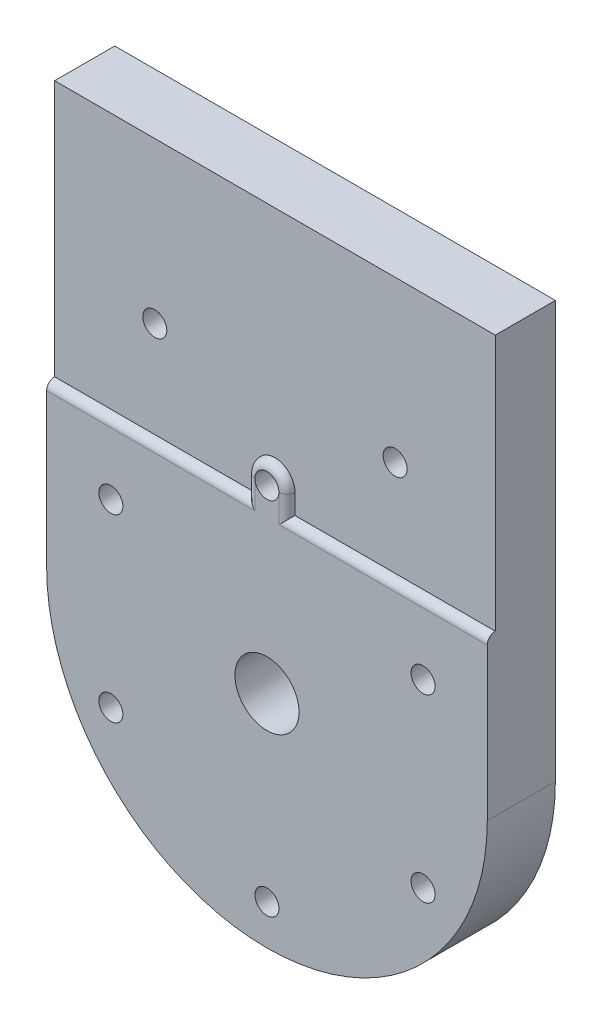
ISO-10303-21;
HEADER;
FILE_DESCRIPTION(('STEP AP214'),'2;1');
FILE_NAME('part.step','',(''),(''),'','','');
FILE_SCHEMA(('AUTOMOTIVE_DESIGN { 1 0 10303 214 1 1 1 1 }'));
ENDSEC;
DATA;
#1=APPLICATION_CONTEXT('core data for automotive mechanical design processes');
#2=APPLICATION_PROTOCOL_DEFINITION('international standard','automotive_design',2000,#1);
#3=PRODUCT_CONTEXT('',#1,'mechanical');
#4=PRODUCT('Part','Part','',(#3));
#5=PRODUCT_RELATED_PRODUCT_CATEGORY('part','',(#4));
#6=PRODUCT_DEFINITION_FORMATION('','',#4);
#7=PRODUCT_DEFINITION_CONTEXT('part definition',#1,'design');
#8=PRODUCT_DEFINITION('design','',#6,#7);
#9=PRODUCT_DEFINITION_SHAPE('','',#8);
#10=(LENGTH_UNIT() NAMED_UNIT(*) SI_UNIT(.MILLI.,.METRE.));
#11=(NAMED_UNIT(*) PLANE_ANGLE_UNIT() SI_UNIT($,.RADIAN.));
#12=(NAMED_UNIT(*) SI_UNIT($,.STERADIAN.) SOLID_ANGLE_UNIT());
#13=UNCERTAINTY_MEASURE_WITH_UNIT(LENGTH_MEASURE(1.E-05),#10,'distance_accuracy_value','');
#14=(GEOMETRIC_REPRESENTATION_CONTEXT(3) GLOBAL_UNCERTAINTY_ASSIGNED_CONTEXT((#13)) GLOBAL_UNIT_ASSIGNED_CONTEXT((#10,
#11,#12)) REPRESENTATION_CONTEXT('',''));
#15=CARTESIAN_POINT('',(0.,0.,0.));
#16=DIRECTION('',(0.,0.,1.));
#17=DIRECTION('',(1.,0.,0.));
#18=AXIS2_PLACEMENT_3D('',#15,#16,#17);
#19=CARTESIAN_POINT('',(19.4855715851503,11.2500000000007,0.));
#20=DIRECTION('',(0.,0.,1.));
#21=DIRECTION('',(1.,0.,0.));
#22=AXIS2_PLACEMENT_3D('',#19,#20,#21);
#23=CYLINDRICAL_SURFACE('',#22,1.50000000000181);
#24=CARTESIAN_POINT('',(19.4855715851503,11.2500000000007,8.5));
#25=DIRECTION('',(0.,0.,1.));
#26=DIRECTION('',(1.,0.,0.));
#27=AXIS2_PLACEMENT_3D('',#24,#25,#26);
#28=CIRCLE('',#27,1.50000000000181);
#29=CARTESIAN_POINT('',(20.9855715851521,11.2500000000007,8.5));
#30=VERTEX_POINT('',#29);
#31=EDGE_CURVE('E519',#30,#30,#28,.T.);
#32=ORIENTED_EDGE('',*,*,#31,.T.);
#33=EDGE_LOOP('',(#32));
#34=FACE_BOUND('',#33,.T.);
#35=CARTESIAN_POINT('',(19.4855715851503,11.2500000000007,4.));
#36=DIRECTION('',(0.,0.,-1.));
#37=DIRECTION('',(-1.,0.,0.));
#38=AXIS2_PLACEMENT_3D('',#35,#36,#37);
#39=CIRCLE('',#38,1.50000000000181);
#40=CARTESIAN_POINT('',(17.9855715851485,11.2500000000007,4.));
#41=VERTEX_POINT('',#40);
#42=EDGE_CURVE('E261',#41,#41,#39,.F.);
#43=ORIENTED_EDGE('',*,*,#42,.F.);
#44=EDGE_LOOP('',(#43));
#45=FACE_BOUND('',#44,.T.);
#46=ADVANCED_FACE('F257',(#34,#45),#23,.F.);
#47=CARTESIAN_POINT('',(0.,22.5,0.));
#48=DIRECTION('',(0.,0.,1.));
#49=DIRECTION('',(1.,0.,0.));
#50=AXIS2_PLACEMENT_3D('',#47,#48,#49);
#51=CYLINDRICAL_SURFACE('',#50,1.50000000000181);
#52=CARTESIAN_POINT('',(0.,22.5,8.5));
#53=DIRECTION('',(0.,0.,1.));
#54=DIRECTION('',(1.,0.,0.));
#55=AXIS2_PLACEMENT_3D('',#52,#53,#54);
#56=CIRCLE('',#55,1.50000000000181);
#57=CARTESIAN_POINT('',(1.50000000000001,22.5,8.5));
#58=VERTEX_POINT('',#57);
#59=CARTESIAN_POINT('',(-1.49999999999999,22.5,8.5));
#60=VERTEX_POINT('',#59);
#61=EDGE_CURVE('E362',#58,#60,#56,.T.);
#62=ORIENTED_EDGE('',*,*,#61,.T.);
#63=EDGE_CURVE('E518',#60,#58,#56,.T.);
#64=ORIENTED_EDGE('',*,*,#63,.T.);
#65=EDGE_LOOP('',(#62,#64));
#66=FACE_BOUND('',#65,.T.);
#67=CARTESIAN_POINT('',(0.,22.5,4.));
#68=DIRECTION('',(0.,0.,-1.));
#69=DIRECTION('',(-1.,0.,0.));
#70=AXIS2_PLACEMENT_3D('',#67,#68,#69);
#71=CIRCLE('',#70,1.50000000000181);
#72=CARTESIAN_POINT('',(-1.50000000000181,22.5,4.));
#73=VERTEX_POINT('',#72);
#74=EDGE_CURVE('E391',#73,#73,#71,.F.);
#75=ORIENTED_EDGE('',*,*,#74,.F.);
#76=EDGE_LOOP('',(#75));
#77=FACE_BOUND('',#76,.T.);
#78=ADVANCED_FACE('F403',(#66,#77),#51,.F.);
#79=CARTESIAN_POINT('',(1.70071014032744E-12,-22.5,0.));
#80=DIRECTION('',(0.,0.,1.));
#81=DIRECTION('',(1.,0.,0.));
#82=AXIS2_PLACEMENT_3D('',#79,#80,#81);
#83=CYLINDRICAL_SURFACE('',#82,1.50000000000181);
#84=CARTESIAN_POINT('',(1.70071014032744E-12,-22.5,8.5));
#85=DIRECTION('',(0.,0.,1.));
#86=DIRECTION('',(1.,0.,0.));
#87=AXIS2_PLACEMENT_3D('',#84,#85,#86);
#88=CIRCLE('',#87,1.50000000000181);
#89=CARTESIAN_POINT('',(1.50000000000351,-22.5,8.5));
#90=VERTEX_POINT('',#89);
#91=EDGE_CURVE('E537',#90,#90,#88,.T.);
#92=ORIENTED_EDGE('',*,*,#91,.T.);
#93=EDGE_LOOP('',(#92));
#94=FACE_BOUND('',#93,.T.);
#95=CARTESIAN_POINT('',(1.70071014032744E-12,-22.5,4.));
#96=DIRECTION('',(0.,0.,-1.));
#97=DIRECTION('',(-1.,0.,0.));
#98=AXIS2_PLACEMENT_3D('',#95,#96,#97);
#99=CIRCLE('',#98,1.50000000000181);
#100=CARTESIAN_POINT('',(-1.50000000000011,-22.5,4.));
#101=VERTEX_POINT('',#100);
#102=EDGE_CURVE('E388',#101,#101,#99,.F.);
#103=ORIENTED_EDGE('',*,*,#102,.F.);
#104=EDGE_LOOP('',(#103));
#105=FACE_BOUND('',#104,.T.);
#106=ADVANCED_FACE('F409',(#94,#105),#83,.F.);
#107=CARTESIAN_POINT('',(-19.4855715851486,-11.2500000000007,0.));
#108=DIRECTION('',(0.,0.,1.));
#109=DIRECTION('',(1.,0.,0.));
#110=AXIS2_PLACEMENT_3D('',#107,#108,#109);
#111=CYLINDRICAL_SURFACE('',#110,1.50000000000181);
#112=CARTESIAN_POINT('',(-19.4855715851486,-11.2500000000007,8.5));
#113=DIRECTION('',(0.,0.,1.));
#114=DIRECTION('',(1.,0.,0.));
#115=AXIS2_PLACEMENT_3D('',#112,#113,#114);
#116=CIRCLE('',#115,1.50000000000181);
#117=CARTESIAN_POINT('',(-17.9855715851468,-11.2500000000007,8.5));
#118=VERTEX_POINT('',#117);
#119=EDGE_CURVE('E533',#118,#118,#116,.T.);
#120=ORIENTED_EDGE('',*,*,#119,.T.);
#121=EDGE_LOOP('',(#120));
#122=FACE_BOUND('',#121,.T.);
#123=CARTESIAN_POINT('',(-19.4855715851486,-11.2500000000007,4.));
#124=DIRECTION('',(0.,0.,-1.));
#125=DIRECTION('',(-1.,0.,0.));
#126=AXIS2_PLACEMENT_3D('',#123,#124,#125);
#127=CIRCLE('',#126,1.50000000000181);
#128=CARTESIAN_POINT('',(-20.9855715851504,-11.2500000000007,4.));
#129=VERTEX_POINT('',#128);
#130=EDGE_CURVE('E384',#129,#129,#127,.F.);
#131=ORIENTED_EDGE('',*,*,#130,.F.);
#132=EDGE_LOOP('',(#131));
#133=FACE_BOUND('',#132,.T.);
#134=ADVANCED_FACE('F429',(#122,#133),#111,.F.);
#135=CARTESIAN_POINT('',(-19.4855715851495,11.2499999999992,0.));
#136=DIRECTION('',(0.,0.,1.));
#137=DIRECTION('',(1.,0.,0.));
#138=AXIS2_PLACEMENT_3D('',#135,#136,#137);
#139=CYLINDRICAL_SURFACE('',#138,1.50000000000181);
#140=CARTESIAN_POINT('',(-19.4855715851495,11.2499999999992,8.5));
#141=DIRECTION('',(0.,0.,1.));
#142=DIRECTION('',(1.,0.,0.));
#143=AXIS2_PLACEMENT_3D('',#140,#141,#142);
#144=CIRCLE('',#143,1.50000000000181);
#145=CARTESIAN_POINT('',(-17.9855715851476,11.2499999999992,8.5));
#146=VERTEX_POINT('',#145);
#147=EDGE_CURVE('E529',#146,#146,#144,.T.);
#148=ORIENTED_EDGE('',*,*,#147,.T.);
#149=EDGE_LOOP('',(#148));
#150=FACE_BOUND('',#149,.T.);
#151=CARTESIAN_POINT('',(-19.4855715851495,11.2499999999992,4.));
#152=DIRECTION('',(0.,0.,-1.));
#153=DIRECTION('',(-1.,0.,0.));
#154=AXIS2_PLACEMENT_3D('',#151,#152,#153);
#155=CIRCLE('',#154,1.50000000000181);
#156=CARTESIAN_POINT('',(-20.9855715851513,11.2499999999992,4.));
#157=VERTEX_POINT('',#156);
#158=EDGE_CURVE('E379',#157,#157,#155,.F.);
#159=ORIENTED_EDGE('',*,*,#158,.F.);
#160=EDGE_LOOP('',(#159));
#161=FACE_BOUND('',#160,.T.);
#162=ADVANCED_FACE('F425',(#150,#161),#139,.F.);
#163=CARTESIAN_POINT('',(19.4855715851511,-11.2499999999993,0.));
#164=DIRECTION('',(0.,0.,1.));
#165=DIRECTION('',(1.,0.,0.));
#166=AXIS2_PLACEMENT_3D('',#163,#164,#165);
#167=CYLINDRICAL_SURFACE('',#166,1.50000000000181);
#168=CARTESIAN_POINT('',(19.4855715851511,-11.2499999999993,8.5));
#169=DIRECTION('',(0.,0.,1.));
#170=DIRECTION('',(1.,0.,0.));
#171=AXIS2_PLACEMENT_3D('',#168,#169,#170);
#172=CIRCLE('',#171,1.50000000000181);
#173=CARTESIAN_POINT('',(20.985571585153,-11.2499999999993,8.5));
#174=VERTEX_POINT('',#173);
#175=EDGE_CURVE('E517',#174,#174,#172,.T.);
#176=ORIENTED_EDGE('',*,*,#175,.T.);
#177=EDGE_LOOP('',(#176));
#178=FACE_BOUND('',#177,.T.);
#179=CARTESIAN_POINT('',(19.4855715851511,-11.2499999999993,4.));
#180=DIRECTION('',(0.,0.,-1.));
#181=DIRECTION('',(-1.,0.,0.));
#182=AXIS2_PLACEMENT_3D('',#179,#180,#181);
#183=CIRCLE('',#182,1.50000000000181);
#184=CARTESIAN_POINT('',(17.9855715851493,-11.2499999999993,4.));
#185=VERTEX_POINT('',#184);
#186=EDGE_CURVE('E375',#185,#185,#183,.F.);
#187=ORIENTED_EDGE('',*,*,#186,.F.);
#188=EDGE_LOOP('',(#187));
#189=FACE_BOUND('',#188,.T.);
#190=ADVANCED_FACE('F428',(#178,#189),#167,.F.);
#191=CARTESIAN_POINT('',(0.,52.,8.5));
#192=DIRECTION('',(0.,1.,0.));
#193=DIRECTION('',(0.,0.,1.));
#194=AXIS2_PLACEMENT_3D('',#191,#192,#193);
#195=PLANE('',#194);
#196=DIRECTION('',(0.,0.,1.));
#197=VECTOR('',#196,1.);
#198=CARTESIAN_POINT('',(-27.5,52.,0.));
#199=LINE('',#198,#197);
#200=CARTESIAN_POINT('',(-27.5,52.,0.));
#201=VERTEX_POINT('',#200);
#202=CARTESIAN_POINT('',(-27.5,52.,7.5));
#203=VERTEX_POINT('',#202);
#204=EDGE_CURVE('E573',#201,#203,#199,.T.);
#205=ORIENTED_EDGE('',*,*,#204,.T.);
#206=DIRECTION('',(-1.,0.,0.));
#207=VECTOR('',#206,1.);
#208=CARTESIAN_POINT('',(0.,52.,7.5));
#209=LINE('',#208,#207);
#210=CARTESIAN_POINT('',(27.5,52.,7.5));
#211=VERTEX_POINT('',#210);
#212=EDGE_CURVE('E494',#211,#203,#209,.T.);
#213=ORIENTED_EDGE('',*,*,#212,.F.);
#214=DIRECTION('',(0.,0.,1.));
#215=VECTOR('',#214,1.);
#216=CARTESIAN_POINT('',(27.5,52.,0.));
#217=LINE('',#216,#215);
#218=CARTESIAN_POINT('',(27.5,52.,0.));
#219=VERTEX_POINT('',#218);
#220=EDGE_CURVE('E569',#219,#211,#217,.T.);
#221=ORIENTED_EDGE('',*,*,#220,.F.);
#222=DIRECTION('',(1.,0.,0.));
#223=VECTOR('',#222,1.);
#224=CARTESIAN_POINT('',(0.,52.,0.));
#225=LINE('',#224,#223);
#226=EDGE_CURVE('E582',#201,#219,#225,.T.);
#227=ORIENTED_EDGE('',*,*,#226,.F.);
#228=EDGE_LOOP('',(#205,#213,#221,#227));
#229=FACE_BOUND('',#228,.T.);
#230=ADVANCED_FACE('F423',(#229),#195,.T.);
#231=CARTESIAN_POINT('',(15.,32.,0.));
#232=DIRECTION('',(0.,0.,1.));
#233=DIRECTION('',(1.,0.,0.));
#234=AXIS2_PLACEMENT_3D('',#231,#232,#233);
#235=CYLINDRICAL_SURFACE('',#234,1.5);
#236=CARTESIAN_POINT('',(15.,32.,0.));
#237=DIRECTION('',(0.,0.,1.));
#238=DIRECTION('',(1.,0.,0.));
#239=AXIS2_PLACEMENT_3D('',#236,#237,#238);
#240=CIRCLE('',#239,1.5);
#241=CARTESIAN_POINT('',(16.5,32.,0.));
#242=VERTEX_POINT('',#241);
#243=EDGE_CURVE('E514',#242,#242,#240,.T.);
#244=ORIENTED_EDGE('',*,*,#243,.F.);
#245=EDGE_LOOP('',(#244));
#246=FACE_BOUND('',#245,.T.);
#247=CARTESIAN_POINT('',(15.,32.,7.5));
#248=DIRECTION('',(0.,0.,1.));
#249=DIRECTION('',(1.,0.,0.));
#250=AXIS2_PLACEMENT_3D('',#247,#248,#249);
#251=CIRCLE('',#250,1.5);
#252=CARTESIAN_POINT('',(16.5,32.,7.5));
#253=VERTEX_POINT('',#252);
#254=EDGE_CURVE('E510',#253,#253,#251,.F.);
#255=ORIENTED_EDGE('',*,*,#254,.F.);
#256=EDGE_LOOP('',(#255));
#257=FACE_BOUND('',#256,.T.);
#258=ADVANCED_FACE('F419',(#246,#257),#235,.F.);
#259=CARTESIAN_POINT('',(-15.,32.,0.));
#260=DIRECTION('',(0.,0.,1.));
#261=DIRECTION('',(1.,0.,0.));
#262=AXIS2_PLACEMENT_3D('',#259,#260,#261);
#263=CYLINDRICAL_SURFACE('',#262,1.5);
#264=CARTESIAN_POINT('',(-15.,32.,0.));
#265=DIRECTION('',(0.,0.,1.));
#266=DIRECTION('',(1.,0.,0.));
#267=AXIS2_PLACEMENT_3D('',#264,#265,#266);
#268=CIRCLE('',#267,1.5);
#269=CARTESIAN_POINT('',(-13.5,32.,0.));
#270=VERTEX_POINT('',#269);
#271=EDGE_CURVE('E522',#270,#270,#268,.T.);
#272=ORIENTED_EDGE('',*,*,#271,.F.);
#273=EDGE_LOOP('',(#272));
#274=FACE_BOUND('',#273,.T.);
#275=CARTESIAN_POINT('',(-15.,32.,7.5));
#276=DIRECTION('',(0.,0.,1.));
#277=DIRECTION('',(1.,0.,0.));
#278=AXIS2_PLACEMENT_3D('',#275,#276,#277);
#279=CIRCLE('',#278,1.5);
#280=CARTESIAN_POINT('',(-13.5,32.,7.5));
#281=VERTEX_POINT('',#280);
#282=EDGE_CURVE('E506',#281,#281,#279,.F.);
#283=ORIENTED_EDGE('',*,*,#282,.F.);
#284=EDGE_LOOP('',(#283));
#285=FACE_BOUND('',#284,.T.);
#286=ADVANCED_FACE('F415',(#274,#285),#263,.F.);
#287=CARTESIAN_POINT('',(0.,0.,8.5));
#288=DIRECTION('',(0.,0.,1.));
#289=DIRECTION('',(1.,0.,0.));
#290=AXIS2_PLACEMENT_3D('',#287,#288,#289);
#291=PLANE('',#290);
#292=ORIENTED_EDGE('',*,*,#175,.F.);
#293=EDGE_LOOP('',(#292));
#294=FACE_BOUND('',#293,.T.);
#295=ORIENTED_EDGE('',*,*,#147,.F.);
#296=EDGE_LOOP('',(#295));
#297=FACE_BOUND('',#296,.T.);
#298=ORIENTED_EDGE('',*,*,#119,.F.);
#299=EDGE_LOOP('',(#298));
#300=FACE_BOUND('',#299,.T.);
#301=ORIENTED_EDGE('',*,*,#91,.F.);
#302=EDGE_LOOP('',(#301));
#303=FACE_BOUND('',#302,.T.);
#304=DIRECTION('',(1.,0.,0.));
#305=VECTOR('',#304,1.);
#306=CARTESIAN_POINT('',(2.50000000000001,19.,8.5));
#307=LINE('',#306,#305);
#308=CARTESIAN_POINT('',(27.5,19.,8.5));
#309=VERTEX_POINT('',#308);
#310=CARTESIAN_POINT('',(1.50000000000001,19.,8.5));
#311=VERTEX_POINT('',#310);
#312=EDGE_CURVE('E275',#309,#311,#307,.F.);
#313=ORIENTED_EDGE('',*,*,#312,.T.);
#314=DIRECTION('',(0.,1.,0.));
#315=VECTOR('',#314,1.);
#316=CARTESIAN_POINT('',(1.50000000000002,0.,8.5));
#317=LINE('',#316,#315);
#318=EDGE_CURVE('E595',#311,#58,#317,.T.);
#319=ORIENTED_EDGE('',*,*,#318,.T.);
#320=ORIENTED_EDGE('',*,*,#63,.F.);
#321=DIRECTION('',(0.,1.,0.));
#322=VECTOR('',#321,1.);
#323=CARTESIAN_POINT('',(-1.49999999999999,20.,8.5));
#324=LINE('',#323,#322);
#325=CARTESIAN_POINT('',(-1.49999999999999,19.,8.5));
#326=VERTEX_POINT('',#325);
#327=EDGE_CURVE('E282',#60,#326,#324,.F.);
#328=ORIENTED_EDGE('',*,*,#327,.T.);
#329=DIRECTION('',(1.,0.,0.));
#330=VECTOR('',#329,1.);
#331=CARTESIAN_POINT('',(-27.5,19.,8.5));
#332=LINE('',#331,#330);
#333=CARTESIAN_POINT('',(-27.5,19.,8.5));
#334=VERTEX_POINT('',#333);
#335=EDGE_CURVE('E484',#326,#334,#332,.F.);
#336=ORIENTED_EDGE('',*,*,#335,.T.);
#337=DIRECTION('',(0.,1.,0.));
#338=VECTOR('',#337,1.);
#339=CARTESIAN_POINT('',(-27.5,0.,8.5));
#340=LINE('',#339,#338);
#341=CARTESIAN_POINT('',(-27.5,0.,8.5));
#342=VERTEX_POINT('',#341);
#343=EDGE_CURVE('E492',#342,#334,#340,.T.);
#344=ORIENTED_EDGE('',*,*,#343,.F.);
#345=CARTESIAN_POINT('',(0.,0.,8.5));
#346=DIRECTION('',(0.,0.,1.));
#347=DIRECTION('',(1.,0.,0.));
#348=AXIS2_PLACEMENT_3D('',#345,#346,#347);
#349=CIRCLE('',#348,27.5);
#350=CARTESIAN_POINT('',(27.5,0.,8.5));
#351=VERTEX_POINT('',#350);
#352=EDGE_CURVE('E541',#342,#351,#349,.T.);
#353=ORIENTED_EDGE('',*,*,#352,.T.);
#354=DIRECTION('',(0.,1.,0.));
#355=VECTOR('',#354,1.);
#356=CARTESIAN_POINT('',(27.5,0.,8.5));
#357=LINE('',#356,#355);
#358=EDGE_CURVE('E549',#351,#309,#357,.T.);
#359=ORIENTED_EDGE('',*,*,#358,.T.);
#360=EDGE_LOOP('',(#313,#319,#320,#328,#336,#344,#353,#359));
#361=FACE_BOUND('',#360,.T.);
#362=ORIENTED_EDGE('',*,*,#31,.F.);
#363=EDGE_LOOP('',(#362));
#364=FACE_BOUND('',#363,.T.);
#365=CARTESIAN_POINT('',(0.,0.,8.5));
#366=DIRECTION('',(0.,0.,1.));
#367=DIRECTION('',(1.,0.,0.));
#368=AXIS2_PLACEMENT_3D('',#365,#366,#367);
#369=CIRCLE('',#368,4.);
#370=CARTESIAN_POINT('',(4.,0.,8.5));
#371=VERTEX_POINT('',#370);
#372=EDGE_CURVE('E578',#371,#371,#369,.T.);
#373=ORIENTED_EDGE('',*,*,#372,.F.);
#374=EDGE_LOOP('',(#373));
#375=FACE_BOUND('',#374,.T.);
#376=ADVANCED_FACE('F418',(#294,#297,#300,#303,#361,#364,#375),#291,.T.);
#377=CARTESIAN_POINT('',(0.,0.,0.));
#378=DIRECTION('',(0.,0.,1.));
#379=DIRECTION('',(1.,0.,0.));
#380=AXIS2_PLACEMENT_3D('',#377,#378,#379);
#381=PLANE('',#380);
#382=CARTESIAN_POINT('',(0.,22.5,0.));
#383=DIRECTION('',(0.,0.,-1.));
#384=DIRECTION('',(-1.,0.,0.));
#385=AXIS2_PLACEMENT_3D('',#382,#383,#384);
#386=CIRCLE('',#385,3.);
#387=CARTESIAN_POINT('',(-3.,22.5,0.));
#388=VERTEX_POINT('',#387);
#389=EDGE_CURVE('E643',#388,#388,#386,.T.);
#390=ORIENTED_EDGE('',*,*,#389,.F.);
#391=EDGE_LOOP('',(#390));
#392=FACE_BOUND('',#391,.T.);
#393=CARTESIAN_POINT('',(19.4855715851492,11.2499999999989,0.));
#394=DIRECTION('',(0.,0.,-1.));
#395=DIRECTION('',(-1.,0.,0.));
#396=AXIS2_PLACEMENT_3D('',#393,#394,#395);
#397=CIRCLE('',#396,3.0000000000012);
#398=CARTESIAN_POINT('',(16.485571585148,11.2499999999989,0.));
#399=VERTEX_POINT('',#398);
#400=EDGE_CURVE('E644',#399,#399,#397,.T.);
#401=ORIENTED_EDGE('',*,*,#400,.F.);
#402=EDGE_LOOP('',(#401));
#403=FACE_BOUND('',#402,.T.);
#404=CARTESIAN_POINT('',(19.485571585148,-11.2500000000011,0.));
#405=DIRECTION('',(0.,0.,-1.));
#406=DIRECTION('',(-1.,0.,0.));
#407=AXIS2_PLACEMENT_3D('',#404,#405,#406);
#408=CIRCLE('',#407,3.00000000000236);
#409=CARTESIAN_POINT('',(16.4855715851456,-11.2500000000011,0.));
#410=VERTEX_POINT('',#409);
#411=EDGE_CURVE('E610',#410,#410,#408,.T.);
#412=ORIENTED_EDGE('',*,*,#411,.F.);
#413=EDGE_LOOP('',(#412));
#414=FACE_BOUND('',#413,.T.);
#415=CARTESIAN_POINT('',(-2.54968748284212E-12,-22.5,0.));
#416=DIRECTION('',(0.,0.,-1.));
#417=DIRECTION('',(-1.,0.,0.));
#418=AXIS2_PLACEMENT_3D('',#415,#416,#417);
#419=CIRCLE('',#418,3.00000000000259);
#420=CARTESIAN_POINT('',(-3.00000000000514,-22.5,0.));
#421=VERTEX_POINT('',#420);
#422=EDGE_CURVE('E619',#421,#421,#419,.T.);
#423=ORIENTED_EDGE('',*,*,#422,.F.);
#424=EDGE_LOOP('',(#423));
#425=FACE_BOUND('',#424,.T.);
#426=CARTESIAN_POINT('',(-19.4855715851518,-11.2499999999989,0.));
#427=DIRECTION('',(0.,0.,-1.));
#428=DIRECTION('',(-1.,0.,0.));
#429=AXIS2_PLACEMENT_3D('',#426,#427,#428);
#430=CIRCLE('',#429,3.00000000000161);
#431=CARTESIAN_POINT('',(-22.4855715851534,-11.2499999999989,0.));
#432=VERTEX_POINT('',#431);
#433=EDGE_CURVE('E627',#432,#432,#430,.T.);
#434=ORIENTED_EDGE('',*,*,#433,.F.);
#435=EDGE_LOOP('',(#434));
#436=FACE_BOUND('',#435,.T.);
#437=CARTESIAN_POINT('',(-19.4855715851505,11.2500000000011,0.));
#438=DIRECTION('',(0.,0.,-1.));
#439=DIRECTION('',(-1.,0.,0.));
#440=AXIS2_PLACEMENT_3D('',#437,#438,#439);
#441=CIRCLE('',#440,3.00000000000034);
#442=CARTESIAN_POINT('',(-22.4855715851508,11.2500000000011,0.));
#443=VERTEX_POINT('',#442);
#444=EDGE_CURVE('E635',#443,#443,#441,.T.);
#445=ORIENTED_EDGE('',*,*,#444,.F.);
#446=EDGE_LOOP('',(#445));
#447=FACE_BOUND('',#446,.T.);
#448=ORIENTED_EDGE('',*,*,#271,.T.);
#449=EDGE_LOOP('',(#448));
#450=FACE_BOUND('',#449,.T.);
#451=ORIENTED_EDGE('',*,*,#243,.T.);
#452=EDGE_LOOP('',(#451));
#453=FACE_BOUND('',#452,.T.);
#454=CARTESIAN_POINT('',(0.,0.,0.));
#455=DIRECTION('',(0.,0.,1.));
#456=DIRECTION('',(1.,0.,0.));
#457=AXIS2_PLACEMENT_3D('',#454,#455,#456);
#458=CIRCLE('',#457,4.);
#459=CARTESIAN_POINT('',(4.,0.,0.));
#460=VERTEX_POINT('',#459);
#461=EDGE_CURVE('E568',#460,#460,#458,.T.);
#462=ORIENTED_EDGE('',*,*,#461,.T.);
#463=EDGE_LOOP('',(#462));
#464=FACE_BOUND('',#463,.T.);
#465=DIRECTION('',(0.,1.,0.));
#466=VECTOR('',#465,1.);
#467=CARTESIAN_POINT('',(27.5,0.,0.));
#468=LINE('',#467,#466);
#469=CARTESIAN_POINT('',(27.5,0.,0.));
#470=VERTEX_POINT('',#469);
#471=EDGE_CURVE('E553',#470,#219,#468,.T.);
#472=ORIENTED_EDGE('',*,*,#471,.F.);
#473=CARTESIAN_POINT('',(0.,0.,0.));
#474=DIRECTION('',(0.,0.,1.));
#475=DIRECTION('',(1.,0.,0.));
#476=AXIS2_PLACEMENT_3D('',#473,#474,#475);
#477=CIRCLE('',#476,27.5);
#478=CARTESIAN_POINT('',(-27.5,0.,0.));
#479=VERTEX_POINT('',#478);
#480=EDGE_CURVE('E545',#479,#470,#477,.T.);
#481=ORIENTED_EDGE('',*,*,#480,.F.);
#482=DIRECTION('',(0.,1.,0.));
#483=VECTOR('',#482,1.);
#484=CARTESIAN_POINT('',(-27.5,0.,0.));
#485=LINE('',#484,#483);
#486=EDGE_CURVE('E548',#479,#201,#485,.T.);
#487=ORIENTED_EDGE('',*,*,#486,.T.);
#488=ORIENTED_EDGE('',*,*,#226,.T.);
#489=EDGE_LOOP('',(#472,#481,#487,#488));
#490=FACE_BOUND('',#489,.T.);
#491=ADVANCED_FACE('F455',(#392,#403,#414,#425,#436,#447,#450,#453,#464,#490),#381,.F.);
#492=CARTESIAN_POINT('',(0.,0.,8.5));
#493=DIRECTION('',(0.,0.,-1.));
#494=DIRECTION('',(-1.,0.,0.));
#495=AXIS2_PLACEMENT_3D('',#492,#493,#494);
#496=CYLINDRICAL_SURFACE('',#495,4.);
#497=ORIENTED_EDGE('',*,*,#372,.T.);
#498=EDGE_LOOP('',(#497));
#499=FACE_BOUND('',#498,.T.);
#500=ORIENTED_EDGE('',*,*,#461,.F.);
#501=EDGE_LOOP('',(#500));
#502=FACE_BOUND('',#501,.T.);
#503=ADVANCED_FACE('F451',(#499,#502),#496,.F.);
#504=CARTESIAN_POINT('',(0.,0.,0.));
#505=DIRECTION('',(0.,0.,1.));
#506=DIRECTION('',(1.,0.,0.));
#507=AXIS2_PLACEMENT_3D('',#504,#505,#506);
#508=CYLINDRICAL_SURFACE('',#507,27.5);
#509=ORIENTED_EDGE('',*,*,#352,.F.);
#510=DIRECTION('',(0.,0.,1.));
#511=VECTOR('',#510,1.);
#512=CARTESIAN_POINT('',(-27.5,0.,0.));
#513=LINE('',#512,#511);
#514=EDGE_CURVE('E556',#479,#342,#513,.T.);
#515=ORIENTED_EDGE('',*,*,#514,.F.);
#516=ORIENTED_EDGE('',*,*,#480,.T.);
#517=DIRECTION('',(0.,0.,1.));
#518=VECTOR('',#517,1.);
#519=CARTESIAN_POINT('',(27.5,0.,0.));
#520=LINE('',#519,#518);
#521=EDGE_CURVE('E564',#470,#351,#520,.T.);
#522=ORIENTED_EDGE('',*,*,#521,.T.);
#523=EDGE_LOOP('',(#509,#515,#516,#522));
#524=FACE_BOUND('',#523,.T.);
#525=ADVANCED_FACE('F444',(#524),#508,.T.);
#526=CARTESIAN_POINT('',(27.5,0.,0.));
#527=DIRECTION('',(1.,0.,0.));
#528=DIRECTION('',(0.,1.,0.));
#529=AXIS2_PLACEMENT_3D('',#526,#527,#528);
#530=PLANE('',#529);
#531=DIRECTION('',(0.,1.,0.));
#532=VECTOR('',#531,1.);
#533=CARTESIAN_POINT('',(27.5,0.,7.5));
#534=LINE('',#533,#532);
#535=CARTESIAN_POINT('',(27.5,20.,7.5));
#536=VERTEX_POINT('',#535);
#537=EDGE_CURVE('E500',#536,#211,#534,.T.);
#538=ORIENTED_EDGE('',*,*,#537,.F.);
#539=CARTESIAN_POINT('',(27.5,19.,7.5));
#540=DIRECTION('',(1.,0.,0.));
#541=DIRECTION('',(0.,1.,0.));
#542=AXIS2_PLACEMENT_3D('',#539,#540,#541);
#543=CIRCLE('',#542,1.);
#544=EDGE_CURVE('E267',#536,#309,#543,.T.);
#545=ORIENTED_EDGE('',*,*,#544,.T.);
#546=ORIENTED_EDGE('',*,*,#358,.F.);
#547=ORIENTED_EDGE('',*,*,#521,.F.);
#548=ORIENTED_EDGE('',*,*,#471,.T.);
#549=ORIENTED_EDGE('',*,*,#220,.T.);
#550=EDGE_LOOP('',(#538,#545,#546,#547,#548,#549));
#551=FACE_BOUND('',#550,.T.);
#552=ADVANCED_FACE('F440',(#551),#530,.T.);
#553=CARTESIAN_POINT('',(-27.5,0.,0.));
#554=DIRECTION('',(1.,0.,0.));
#555=DIRECTION('',(0.,1.,0.));
#556=AXIS2_PLACEMENT_3D('',#553,#554,#555);
#557=PLANE('',#556);
#558=ORIENTED_EDGE('',*,*,#343,.T.);
#559=CARTESIAN_POINT('',(-27.5,19.,7.5));
#560=DIRECTION('',(1.,0.,0.));
#561=DIRECTION('',(0.,1.,0.));
#562=AXIS2_PLACEMENT_3D('',#559,#560,#561);
#563=CIRCLE('',#562,1.);
#564=CARTESIAN_POINT('',(-27.5,20.,7.5));
#565=VERTEX_POINT('',#564);
#566=EDGE_CURVE('E12',#334,#565,#563,.F.);
#567=ORIENTED_EDGE('',*,*,#566,.T.);
#568=DIRECTION('',(0.,-1.,0.));
#569=VECTOR('',#568,1.);
#570=CARTESIAN_POINT('',(-27.5,0.,7.5));
#571=LINE('',#570,#569);
#572=EDGE_CURVE('E489',#203,#565,#571,.T.);
#573=ORIENTED_EDGE('',*,*,#572,.F.);
#574=ORIENTED_EDGE('',*,*,#204,.F.);
#575=ORIENTED_EDGE('',*,*,#486,.F.);
#576=ORIENTED_EDGE('',*,*,#514,.T.);
#577=EDGE_LOOP('',(#558,#567,#573,#574,#575,#576));
#578=FACE_BOUND('',#577,.T.);
#579=ADVANCED_FACE('F443',(#578),#557,.F.);
#580=CARTESIAN_POINT('',(0.,0.,7.5));
#581=DIRECTION('',(0.,0.,1.));
#582=DIRECTION('',(1.,0.,0.));
#583=AXIS2_PLACEMENT_3D('',#580,#581,#582);
#584=PLANE('',#583);
#585=CARTESIAN_POINT('',(0.,22.5,7.5));
#586=DIRECTION('',(0.,0.,1.));
#587=DIRECTION('',(1.,0.,0.));
#588=AXIS2_PLACEMENT_3D('',#585,#586,#587);
#589=CIRCLE('',#588,2.5);
#590=CARTESIAN_POINT('',(2.50000000000001,22.5,7.5));
#591=VERTEX_POINT('',#590);
#592=CARTESIAN_POINT('',(-2.49999999999999,22.5,7.5));
#593=VERTEX_POINT('',#592);
#594=EDGE_CURVE('E336',#591,#593,#589,.T.);
#595=ORIENTED_EDGE('',*,*,#594,.F.);
#596=DIRECTION('',(0.,1.,0.));
#597=VECTOR('',#596,1.);
#598=CARTESIAN_POINT('',(2.50000000000002,0.,7.5));
#599=LINE('',#598,#597);
#600=CARTESIAN_POINT('',(2.50000000000001,20.,7.5));
#601=VERTEX_POINT('',#600);
#602=EDGE_CURVE('E340',#601,#591,#599,.T.);
#603=ORIENTED_EDGE('',*,*,#602,.F.);
#604=DIRECTION('',(1.,0.,0.));
#605=VECTOR('',#604,1.);
#606=CARTESIAN_POINT('',(0.,20.,7.5));
#607=LINE('',#606,#605);
#608=EDGE_CURVE('E358',#601,#536,#607,.T.);
#609=ORIENTED_EDGE('',*,*,#608,.T.);
#610=ORIENTED_EDGE('',*,*,#537,.T.);
#611=ORIENTED_EDGE('',*,*,#212,.T.);
#612=ORIENTED_EDGE('',*,*,#572,.T.);
#613=CARTESIAN_POINT('',(-2.49999999999999,20.,7.5));
#614=VERTEX_POINT('',#613);
#615=EDGE_CURVE('E485',#565,#614,#607,.T.);
#616=ORIENTED_EDGE('',*,*,#615,.T.);
#617=DIRECTION('',(0.,1.,0.));
#618=VECTOR('',#617,1.);
#619=CARTESIAN_POINT('',(-2.49999999999998,0.,7.5));
#620=LINE('',#619,#618);
#621=EDGE_CURVE('E343',#614,#593,#620,.T.);
#622=ORIENTED_EDGE('',*,*,#621,.T.);
#623=EDGE_LOOP('',(#595,#603,#609,#610,#611,#612,#616,#622));
#624=FACE_BOUND('',#623,.T.);
#625=ORIENTED_EDGE('',*,*,#282,.T.);
#626=EDGE_LOOP('',(#625));
#627=FACE_BOUND('',#626,.T.);
#628=ORIENTED_EDGE('',*,*,#254,.T.);
#629=EDGE_LOOP('',(#628));
#630=FACE_BOUND('',#629,.T.);
#631=ADVANCED_FACE('F338',(#624,#627,#630),#584,.T.);
#632=CARTESIAN_POINT('',(0.,19.,7.5));
#633=DIRECTION('',(-1.,0.,0.));
#634=DIRECTION('',(0.,0.,1.));
#635=AXIS2_PLACEMENT_3D('',#632,#633,#634);
#636=CYLINDRICAL_SURFACE('',#635,1.);
#637=ORIENTED_EDGE('',*,*,#544,.F.);
#638=ORIENTED_EDGE('',*,*,#608,.F.);
#639=CARTESIAN_POINT('',(1.50000000000001,19.,7.5));
#640=DIRECTION('',(-0.707106781186548,0.707106781186547,0.));
#641=DIRECTION('',(0.707106781186547,0.707106781186548,0.));
#642=AXIS2_PLACEMENT_3D('',#639,#640,#641);
#643=ELLIPSE('',#642,1.41421356237309,1.);
#644=EDGE_CURVE('E348',#311,#601,#643,.T.);
#645=ORIENTED_EDGE('',*,*,#644,.F.);
#646=ORIENTED_EDGE('',*,*,#312,.F.);
#647=EDGE_LOOP('',(#637,#638,#645,#646));
#648=FACE_BOUND('',#647,.T.);
#649=ADVANCED_FACE('F259',(#648),#636,.T.);
#650=CARTESIAN_POINT('',(0.,19.,7.5));
#651=DIRECTION('',(-1.,0.,0.));
#652=DIRECTION('',(0.,0.,1.));
#653=AXIS2_PLACEMENT_3D('',#650,#651,#652);
#654=CYLINDRICAL_SURFACE('',#653,1.);
#655=ORIENTED_EDGE('',*,*,#566,.F.);
#656=ORIENTED_EDGE('',*,*,#335,.F.);
#657=CARTESIAN_POINT('',(-1.49999999999999,19.,7.5));
#658=DIRECTION('',(-0.707106781186547,-0.707106781186548,0.));
#659=DIRECTION('',(0.707106781186548,-0.707106781186547,0.));
#660=AXIS2_PLACEMENT_3D('',#657,#658,#659);
#661=ELLIPSE('',#660,1.4142135623731,1.);
#662=EDGE_CURVE('E364',#614,#326,#661,.F.);
#663=ORIENTED_EDGE('',*,*,#662,.F.);
#664=ORIENTED_EDGE('',*,*,#615,.F.);
#665=EDGE_LOOP('',(#655,#656,#663,#664));
#666=FACE_BOUND('',#665,.T.);
#667=ADVANCED_FACE('F474',(#666),#654,.T.);
#668=CARTESIAN_POINT('',(1.50000000000002,0.,7.5));
#669=DIRECTION('',(0.,1.,0.));
#670=DIRECTION('',(-1.,0.,0.));
#671=AXIS2_PLACEMENT_3D('',#668,#669,#670);
#672=CYLINDRICAL_SURFACE('',#671,1.);
#673=ORIENTED_EDGE('',*,*,#644,.T.);
#674=ORIENTED_EDGE('',*,*,#602,.T.);
#675=CARTESIAN_POINT('',(1.50000000000001,22.5,7.5));
#676=DIRECTION('',(0.,1.,0.));
#677=DIRECTION('',(0.,0.,1.));
#678=AXIS2_PLACEMENT_3D('',#675,#676,#677);
#679=CIRCLE('',#678,1.);
#680=EDGE_CURVE('E355',#58,#591,#679,.T.);
#681=ORIENTED_EDGE('',*,*,#680,.F.);
#682=ORIENTED_EDGE('',*,*,#318,.F.);
#683=EDGE_LOOP('',(#673,#674,#681,#682));
#684=FACE_BOUND('',#683,.T.);
#685=ADVANCED_FACE('F353',(#684),#672,.T.);
#686=CARTESIAN_POINT('',(-1.49999999999998,0.,7.5));
#687=DIRECTION('',(0.,-1.,0.));
#688=DIRECTION('',(1.,0.,0.));
#689=AXIS2_PLACEMENT_3D('',#686,#687,#688);
#690=CYLINDRICAL_SURFACE('',#689,1.);
#691=ORIENTED_EDGE('',*,*,#662,.T.);
#692=ORIENTED_EDGE('',*,*,#327,.F.);
#693=CARTESIAN_POINT('',(-1.49999999999999,22.5,7.5));
#694=DIRECTION('',(0.,1.,0.));
#695=DIRECTION('',(0.,0.,1.));
#696=AXIS2_PLACEMENT_3D('',#693,#694,#695);
#697=CIRCLE('',#696,1.);
#698=EDGE_CURVE('E365',#593,#60,#697,.T.);
#699=ORIENTED_EDGE('',*,*,#698,.F.);
#700=ORIENTED_EDGE('',*,*,#621,.F.);
#701=EDGE_LOOP('',(#691,#692,#699,#700));
#702=FACE_BOUND('',#701,.T.);
#703=ADVANCED_FACE('F469',(#702),#690,.T.);
#704=CARTESIAN_POINT('',(0.,22.5,7.5));
#705=DIRECTION('',(0.,0.,1.));
#706=DIRECTION('',(1.,0.,0.));
#707=AXIS2_PLACEMENT_3D('',#704,#705,#706);
#708=TOROIDAL_SURFACE('',#707,1.5,1.);
#709=ORIENTED_EDGE('',*,*,#680,.T.);
#710=ORIENTED_EDGE('',*,*,#594,.T.);
#711=ORIENTED_EDGE('',*,*,#698,.T.);
#712=ORIENTED_EDGE('',*,*,#61,.F.);
#713=EDGE_LOOP('',(#709,#710,#711,#712));
#714=FACE_BOUND('',#713,.T.);
#715=ADVANCED_FACE('F360',(#714),#708,.T.);
#716=CARTESIAN_POINT('',(19.485571585148,-11.2500000000011,4.));
#717=DIRECTION('',(0.,0.,-1.));
#718=DIRECTION('',(-1.,0.,0.));
#719=AXIS2_PLACEMENT_3D('',#716,#717,#718);
#720=PLANE('',#719);
#721=CARTESIAN_POINT('',(19.485571585148,-11.2500000000011,4.));
#722=DIRECTION('',(0.,0.,-1.));
#723=DIRECTION('',(-1.,0.,0.));
#724=AXIS2_PLACEMENT_3D('',#721,#722,#723);
#725=CIRCLE('',#724,3.00000000000236);
#726=CARTESIAN_POINT('',(16.4855715851456,-11.2500000000011,4.));
#727=VERTEX_POINT('',#726);
#728=EDGE_CURVE('E614',#727,#727,#725,.T.);
#729=ORIENTED_EDGE('',*,*,#728,.T.);
#730=EDGE_LOOP('',(#729));
#731=FACE_BOUND('',#730,.T.);
#732=ORIENTED_EDGE('',*,*,#186,.T.);
#733=EDGE_LOOP('',(#732));
#734=FACE_BOUND('',#733,.T.);
#735=ADVANCED_FACE('F468',(#731,#734),#720,.T.);
#736=CARTESIAN_POINT('',(19.485571585148,-11.2500000000011,4.));
#737=DIRECTION('',(0.,0.,-1.));
#738=DIRECTION('',(-1.,0.,0.));
#739=AXIS2_PLACEMENT_3D('',#736,#737,#738);
#740=CYLINDRICAL_SURFACE('',#739,3.00000000000236);
#741=ORIENTED_EDGE('',*,*,#728,.F.);
#742=EDGE_LOOP('',(#741));
#743=FACE_BOUND('',#742,.T.);
#744=ORIENTED_EDGE('',*,*,#411,.T.);
#745=EDGE_LOOP('',(#744));
#746=FACE_BOUND('',#745,.T.);
#747=ADVANCED_FACE('F695',(#743,#746),#740,.F.);
#748=CARTESIAN_POINT('',(-19.4855715851505,11.2500000000011,4.));
#749=DIRECTION('',(0.,0.,-1.));
#750=DIRECTION('',(-1.,0.,0.));
#751=AXIS2_PLACEMENT_3D('',#748,#749,#750);
#752=PLANE('',#751);
#753=CARTESIAN_POINT('',(-19.4855715851505,11.2500000000011,4.));
#754=DIRECTION('',(0.,0.,-1.));
#755=DIRECTION('',(-1.,0.,0.));
#756=AXIS2_PLACEMENT_3D('',#753,#754,#755);
#757=CIRCLE('',#756,3.00000000000034);
#758=CARTESIAN_POINT('',(-22.4855715851508,11.2500000000011,4.));
#759=VERTEX_POINT('',#758);
#760=EDGE_CURVE('E639',#759,#759,#757,.T.);
#761=ORIENTED_EDGE('',*,*,#760,.T.);
#762=EDGE_LOOP('',(#761));
#763=FACE_BOUND('',#762,.T.);
#764=ORIENTED_EDGE('',*,*,#158,.T.);
#765=EDGE_LOOP('',(#764));
#766=FACE_BOUND('',#765,.T.);
#767=ADVANCED_FACE('F698',(#763,#766),#752,.T.);
#768=CARTESIAN_POINT('',(-19.4855715851505,11.2500000000011,4.));
#769=DIRECTION('',(0.,0.,-1.));
#770=DIRECTION('',(-1.,0.,0.));
#771=AXIS2_PLACEMENT_3D('',#768,#769,#770);
#772=CYLINDRICAL_SURFACE('',#771,3.00000000000034);
#773=ORIENTED_EDGE('',*,*,#760,.F.);
#774=EDGE_LOOP('',(#773));
#775=FACE_BOUND('',#774,.T.);
#776=ORIENTED_EDGE('',*,*,#444,.T.);
#777=EDGE_LOOP('',(#776));
#778=FACE_BOUND('',#777,.T.);
#779=ADVANCED_FACE('F718',(#775,#778),#772,.F.);
#780=CARTESIAN_POINT('',(-19.4855715851518,-11.2499999999989,4.));
#781=DIRECTION('',(0.,0.,-1.));
#782=DIRECTION('',(-1.,0.,0.));
#783=AXIS2_PLACEMENT_3D('',#780,#781,#782);
#784=PLANE('',#783);
#785=CARTESIAN_POINT('',(-19.4855715851518,-11.2499999999989,4.));
#786=DIRECTION('',(0.,0.,-1.));
#787=DIRECTION('',(-1.,0.,0.));
#788=AXIS2_PLACEMENT_3D('',#785,#786,#787);
#789=CIRCLE('',#788,3.00000000000161);
#790=CARTESIAN_POINT('',(-22.4855715851534,-11.2499999999989,4.));
#791=VERTEX_POINT('',#790);
#792=EDGE_CURVE('E631',#791,#791,#789,.T.);
#793=ORIENTED_EDGE('',*,*,#792,.T.);
#794=EDGE_LOOP('',(#793));
#795=FACE_BOUND('',#794,.T.);
#796=ORIENTED_EDGE('',*,*,#130,.T.);
#797=EDGE_LOOP('',(#796));
#798=FACE_BOUND('',#797,.T.);
#799=ADVANCED_FACE('F714',(#795,#798),#784,.T.);
#800=CARTESIAN_POINT('',(-19.4855715851518,-11.2499999999989,4.));
#801=DIRECTION('',(0.,0.,-1.));
#802=DIRECTION('',(-1.,0.,0.));
#803=AXIS2_PLACEMENT_3D('',#800,#801,#802);
#804=CYLINDRICAL_SURFACE('',#803,3.00000000000161);
#805=ORIENTED_EDGE('',*,*,#792,.F.);
#806=EDGE_LOOP('',(#805));
#807=FACE_BOUND('',#806,.T.);
#808=ORIENTED_EDGE('',*,*,#433,.T.);
#809=EDGE_LOOP('',(#808));
#810=FACE_BOUND('',#809,.T.);
#811=ADVANCED_FACE('F710',(#807,#810),#804,.F.);
#812=CARTESIAN_POINT('',(-2.54968748284212E-12,-22.5,4.));
#813=DIRECTION('',(0.,0.,-1.));
#814=DIRECTION('',(-1.,0.,0.));
#815=AXIS2_PLACEMENT_3D('',#812,#813,#814);
#816=PLANE('',#815);
#817=CARTESIAN_POINT('',(-2.54968748284212E-12,-22.5,4.));
#818=DIRECTION('',(0.,0.,-1.));
#819=DIRECTION('',(-1.,0.,0.));
#820=AXIS2_PLACEMENT_3D('',#817,#818,#819);
#821=CIRCLE('',#820,3.00000000000259);
#822=CARTESIAN_POINT('',(-3.00000000000514,-22.5,4.));
#823=VERTEX_POINT('',#822);
#824=EDGE_CURVE('E623',#823,#823,#821,.T.);
#825=ORIENTED_EDGE('',*,*,#824,.T.);
#826=EDGE_LOOP('',(#825));
#827=FACE_BOUND('',#826,.T.);
#828=ORIENTED_EDGE('',*,*,#102,.T.);
#829=EDGE_LOOP('',(#828));
#830=FACE_BOUND('',#829,.T.);
#831=ADVANCED_FACE('F706',(#827,#830),#816,.T.);
#832=CARTESIAN_POINT('',(-2.54968748284212E-12,-22.5,4.));
#833=DIRECTION('',(0.,0.,-1.));
#834=DIRECTION('',(-1.,0.,0.));
#835=AXIS2_PLACEMENT_3D('',#832,#833,#834);
#836=CYLINDRICAL_SURFACE('',#835,3.00000000000259);
#837=ORIENTED_EDGE('',*,*,#824,.F.);
#838=EDGE_LOOP('',(#837));
#839=FACE_BOUND('',#838,.T.);
#840=ORIENTED_EDGE('',*,*,#422,.T.);
#841=EDGE_LOOP('',(#840));
#842=FACE_BOUND('',#841,.T.);
#843=ADVANCED_FACE('F703',(#839,#842),#836,.F.);
#844=CARTESIAN_POINT('',(0.,22.5,4.));
#845=DIRECTION('',(0.,0.,-1.));
#846=DIRECTION('',(-1.,0.,0.));
#847=AXIS2_PLACEMENT_3D('',#844,#845,#846);
#848=PLANE('',#847);
#849=CARTESIAN_POINT('',(0.,22.5,4.));
#850=DIRECTION('',(0.,0.,-1.));
#851=DIRECTION('',(-1.,0.,0.));
#852=AXIS2_PLACEMENT_3D('',#849,#850,#851);
#853=CIRCLE('',#852,3.);
#854=CARTESIAN_POINT('',(-3.,22.5,4.));
#855=VERTEX_POINT('',#854);
#856=EDGE_CURVE('E380',#855,#855,#853,.T.);
#857=ORIENTED_EDGE('',*,*,#856,.T.);
#858=EDGE_LOOP('',(#857));
#859=FACE_BOUND('',#858,.T.);
#860=ORIENTED_EDGE('',*,*,#74,.T.);
#861=EDGE_LOOP('',(#860));
#862=FACE_BOUND('',#861,.T.);
#863=ADVANCED_FACE('F658',(#859,#862),#848,.T.);
#864=CARTESIAN_POINT('',(0.,22.5,4.));
#865=DIRECTION('',(0.,0.,-1.));
#866=DIRECTION('',(-1.,0.,0.));
#867=AXIS2_PLACEMENT_3D('',#864,#865,#866);
#868=CYLINDRICAL_SURFACE('',#867,3.);
#869=ORIENTED_EDGE('',*,*,#856,.F.);
#870=EDGE_LOOP('',(#869));
#871=FACE_BOUND('',#870,.T.);
#872=ORIENTED_EDGE('',*,*,#389,.T.);
#873=EDGE_LOOP('',(#872));
#874=FACE_BOUND('',#873,.T.);
#875=ADVANCED_FACE('F660',(#871,#874),#868,.F.);
#876=CARTESIAN_POINT('',(19.4855715851492,11.2499999999989,4.));
#877=DIRECTION('',(0.,0.,-1.));
#878=DIRECTION('',(-1.,0.,0.));
#879=AXIS2_PLACEMENT_3D('',#876,#877,#878);
#880=PLANE('',#879);
#881=CARTESIAN_POINT('',(19.4855715851492,11.2499999999989,4.));
#882=DIRECTION('',(0.,0.,-1.));
#883=DIRECTION('',(-1.,0.,0.));
#884=AXIS2_PLACEMENT_3D('',#881,#882,#883);
#885=CIRCLE('',#884,3.0000000000012);
#886=CARTESIAN_POINT('',(16.485571585148,11.2499999999989,4.));
#887=VERTEX_POINT('',#886);
#888=EDGE_CURVE('E615',#887,#887,#885,.T.);
#889=ORIENTED_EDGE('',*,*,#888,.T.);
#890=EDGE_LOOP('',(#889));
#891=FACE_BOUND('',#890,.T.);
#892=ORIENTED_EDGE('',*,*,#42,.T.);
#893=EDGE_LOOP('',(#892));
#894=FACE_BOUND('',#893,.T.);
#895=ADVANCED_FACE('F400',(#891,#894),#880,.T.);
#896=CARTESIAN_POINT('',(19.4855715851492,11.2499999999989,4.));
#897=DIRECTION('',(0.,0.,-1.));
#898=DIRECTION('',(-1.,0.,0.));
#899=AXIS2_PLACEMENT_3D('',#896,#897,#898);
#900=CYLINDRICAL_SURFACE('',#899,3.0000000000012);
#901=ORIENTED_EDGE('',*,*,#888,.F.);
#902=EDGE_LOOP('',(#901));
#903=FACE_BOUND('',#902,.T.);
#904=ORIENTED_EDGE('',*,*,#400,.T.);
#905=EDGE_LOOP('',(#904));
#906=FACE_BOUND('',#905,.T.);
#907=ADVANCED_FACE('F726',(#903,#906),#900,.F.);
#908=CLOSED_SHELL('',(#46,#78,#106,#134,#162,#190,#230,#258,#286,#376,#491,#503,#525,#552,#579,
#631,#649,#667,#685,#703,#715,#735,#747,#767,#779,#799,#811,#831,#843,#863,#875,#895,#907));
#909=MANIFOLD_SOLID_BREP('B2',#908);
#910=ADVANCED_BREP_SHAPE_REPRESENTATION('',(#18,#909),#14);
#911=SHAPE_DEFINITION_REPRESENTATION(#9,#910);
ENDSEC;
END-ISO-10303-21;
